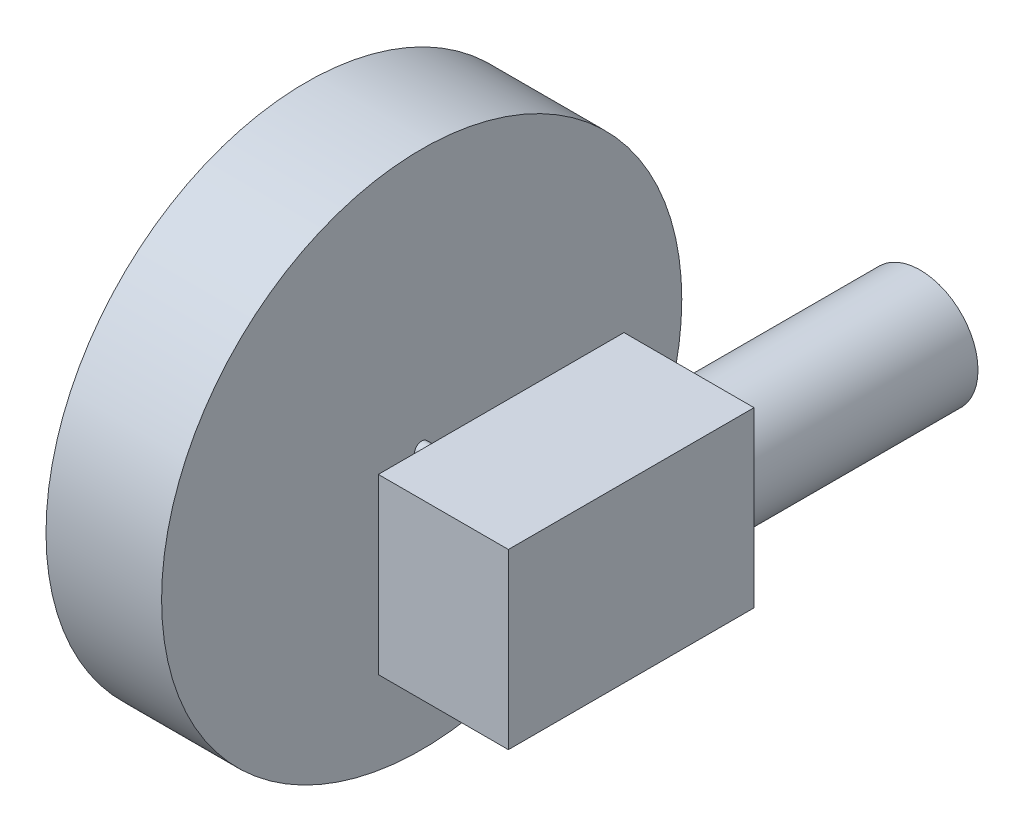
ISO-10303-21;
HEADER;
FILE_DESCRIPTION(('STEP AP214'),'2;1');
FILE_NAME('part.step','',(''),(''),'','','');
FILE_SCHEMA(('AUTOMOTIVE_DESIGN { 1 0 10303 214 1 1 1 1 }'));
ENDSEC;
DATA;
#1=APPLICATION_CONTEXT('core data for automotive mechanical design processes');
#2=APPLICATION_PROTOCOL_DEFINITION('international standard','automotive_design',2000,#1);
#3=PRODUCT_CONTEXT('',#1,'mechanical');
#4=PRODUCT('Part','Part','',(#3));
#5=PRODUCT_RELATED_PRODUCT_CATEGORY('part','',(#4));
#6=PRODUCT_DEFINITION_FORMATION('','',#4);
#7=PRODUCT_DEFINITION_CONTEXT('part definition',#1,'design');
#8=PRODUCT_DEFINITION('design','',#6,#7);
#9=PRODUCT_DEFINITION_SHAPE('','',#8);
#10=(LENGTH_UNIT() NAMED_UNIT(*) SI_UNIT(.MILLI.,.METRE.));
#11=(NAMED_UNIT(*) PLANE_ANGLE_UNIT() SI_UNIT($,.RADIAN.));
#12=(NAMED_UNIT(*) SI_UNIT($,.STERADIAN.) SOLID_ANGLE_UNIT());
#13=UNCERTAINTY_MEASURE_WITH_UNIT(LENGTH_MEASURE(1.E-05),#10,'distance_accuracy_value','');
#14=(GEOMETRIC_REPRESENTATION_CONTEXT(3) GLOBAL_UNCERTAINTY_ASSIGNED_CONTEXT((#13)) GLOBAL_UNIT_ASSIGNED_CONTEXT((#10,
#11,#12)) REPRESENTATION_CONTEXT('',''));
#15=CARTESIAN_POINT('',(0.,0.,0.));
#16=DIRECTION('',(0.,0.,1.));
#17=DIRECTION('',(1.,0.,0.));
#18=AXIS2_PLACEMENT_3D('',#15,#16,#17);
#19=CARTESIAN_POINT('',(-90.,0.,0.));
#20=DIRECTION('',(0.,0.,-1.));
#21=DIRECTION('',(1.,0.,0.));
#22=AXIS2_PLACEMENT_3D('',#19,#20,#21);
#23=PLANE('',#22);
#24=DIRECTION('',(0.,-1.,0.));
#25=VECTOR('',#24,1.);
#26=CARTESIAN_POINT('',(0.,0.,0.));
#27=LINE('',#26,#25);
#28=CARTESIAN_POINT('',(0.,120.,0.));
#29=VERTEX_POINT('',#28);
#30=CARTESIAN_POINT('',(0.,0.,0.));
#31=VERTEX_POINT('',#30);
#32=EDGE_CURVE('E103',#29,#31,#27,.T.);
#33=ORIENTED_EDGE('',*,*,#32,.F.);
#34=DIRECTION('',(1.,0.,0.));
#35=VECTOR('',#34,1.);
#36=CARTESIAN_POINT('',(-90.,120.,0.));
#37=LINE('',#36,#35);
#38=CARTESIAN_POINT('',(-90.,120.,0.));
#39=VERTEX_POINT('',#38);
#40=EDGE_CURVE('E102',#39,#29,#37,.T.);
#41=ORIENTED_EDGE('',*,*,#40,.F.);
#42=DIRECTION('',(0.,-1.,0.));
#43=VECTOR('',#42,1.);
#44=CARTESIAN_POINT('',(-90.,0.,0.));
#45=LINE('',#44,#43);
#46=CARTESIAN_POINT('',(-90.,0.,0.));
#47=VERTEX_POINT('',#46);
#48=EDGE_CURVE('E96',#39,#47,#45,.T.);
#49=ORIENTED_EDGE('',*,*,#48,.T.);
#50=DIRECTION('',(1.,0.,0.));
#51=VECTOR('',#50,1.);
#52=CARTESIAN_POINT('',(-90.,0.,0.));
#53=LINE('',#52,#51);
#54=EDGE_CURVE('E90',#47,#31,#53,.T.);
#55=ORIENTED_EDGE('',*,*,#54,.T.);
#56=EDGE_LOOP('',(#33,#41,#49,#55));
#57=FACE_BOUND('',#56,.T.);
#58=ADVANCED_FACE('F35',(#57),#23,.F.);
#59=CARTESIAN_POINT('',(-90.,0.,0.));
#60=DIRECTION('',(0.,1.,0.));
#61=DIRECTION('',(0.,0.,1.));
#62=AXIS2_PLACEMENT_3D('',#59,#60,#61);
#63=PLANE('',#62);
#64=DIRECTION('',(0.,0.,-1.));
#65=VECTOR('',#64,1.);
#66=CARTESIAN_POINT('',(0.,0.,0.));
#67=LINE('',#66,#65);
#68=CARTESIAN_POINT('',(0.,0.,-170.));
#69=VERTEX_POINT('',#68);
#70=EDGE_CURVE('E105',#31,#69,#67,.T.);
#71=ORIENTED_EDGE('',*,*,#70,.F.);
#72=ORIENTED_EDGE('',*,*,#54,.F.);
#73=DIRECTION('',(0.,0.,-1.));
#74=VECTOR('',#73,1.);
#75=CARTESIAN_POINT('',(-90.,0.,0.));
#76=LINE('',#75,#74);
#77=CARTESIAN_POINT('',(-90.,0.,-170.));
#78=VERTEX_POINT('',#77);
#79=EDGE_CURVE('E76',#47,#78,#76,.T.);
#80=ORIENTED_EDGE('',*,*,#79,.T.);
#81=DIRECTION('',(1.,0.,0.));
#82=VECTOR('',#81,1.);
#83=CARTESIAN_POINT('',(-90.,0.,-170.));
#84=LINE('',#83,#82);
#85=EDGE_CURVE('E85',#78,#69,#84,.T.);
#86=ORIENTED_EDGE('',*,*,#85,.T.);
#87=EDGE_LOOP('',(#71,#72,#80,#86));
#88=FACE_BOUND('',#87,.T.);
#89=ADVANCED_FACE('F93',(#88),#63,.F.);
#90=CARTESIAN_POINT('',(-90.,0.,-170.));
#91=DIRECTION('',(0.,0.,1.));
#92=DIRECTION('',(-1.,0.,0.));
#93=AXIS2_PLACEMENT_3D('',#90,#91,#92);
#94=PLANE('',#93);
#95=CARTESIAN_POINT('',(-45.,60.,-170.));
#96=DIRECTION('',(0.,0.,1.));
#97=DIRECTION('',(1.,0.,0.));
#98=AXIS2_PLACEMENT_3D('',#95,#96,#97);
#99=CIRCLE('',#98,40.);
#100=CARTESIAN_POINT('',(-4.99999999999999,60.,-170.));
#101=VERTEX_POINT('',#100);
#102=EDGE_CURVE('E43',#101,#101,#99,.T.);
#103=ORIENTED_EDGE('',*,*,#102,.T.);
#104=EDGE_LOOP('',(#103));
#105=FACE_BOUND('',#104,.T.);
#106=DIRECTION('',(0.,1.,0.));
#107=VECTOR('',#106,1.);
#108=CARTESIAN_POINT('',(0.,0.,-170.));
#109=LINE('',#108,#107);
#110=CARTESIAN_POINT('',(0.,120.,-170.));
#111=VERTEX_POINT('',#110);
#112=EDGE_CURVE('E87',#69,#111,#109,.T.);
#113=ORIENTED_EDGE('',*,*,#112,.F.);
#114=ORIENTED_EDGE('',*,*,#85,.F.);
#115=DIRECTION('',(0.,1.,0.));
#116=VECTOR('',#115,1.);
#117=CARTESIAN_POINT('',(-90.,0.,-170.));
#118=LINE('',#117,#116);
#119=CARTESIAN_POINT('',(-90.,120.,-170.));
#120=VERTEX_POINT('',#119);
#121=EDGE_CURVE('E79',#78,#120,#118,.T.);
#122=ORIENTED_EDGE('',*,*,#121,.T.);
#123=DIRECTION('',(1.,0.,0.));
#124=VECTOR('',#123,1.);
#125=CARTESIAN_POINT('',(-90.,120.,-170.));
#126=LINE('',#125,#124);
#127=EDGE_CURVE('E91',#120,#111,#126,.T.);
#128=ORIENTED_EDGE('',*,*,#127,.T.);
#129=EDGE_LOOP('',(#113,#114,#122,#128));
#130=FACE_BOUND('',#129,.T.);
#131=ADVANCED_FACE('F86',(#105,#130),#94,.F.);
#132=CARTESIAN_POINT('',(-90.,120.,0.));
#133=DIRECTION('',(0.,-1.,0.));
#134=DIRECTION('',(0.,0.,-1.));
#135=AXIS2_PLACEMENT_3D('',#132,#133,#134);
#136=PLANE('',#135);
#137=DIRECTION('',(0.,0.,1.));
#138=VECTOR('',#137,1.);
#139=CARTESIAN_POINT('',(0.,120.,0.));
#140=LINE('',#139,#138);
#141=EDGE_CURVE('E65',#111,#29,#140,.T.);
#142=ORIENTED_EDGE('',*,*,#141,.F.);
#143=ORIENTED_EDGE('',*,*,#127,.F.);
#144=DIRECTION('',(0.,0.,1.));
#145=VECTOR('',#144,1.);
#146=CARTESIAN_POINT('',(-90.,120.,0.));
#147=LINE('',#146,#145);
#148=EDGE_CURVE('E51',#120,#39,#147,.T.);
#149=ORIENTED_EDGE('',*,*,#148,.T.);
#150=ORIENTED_EDGE('',*,*,#40,.T.);
#151=EDGE_LOOP('',(#142,#143,#149,#150));
#152=FACE_BOUND('',#151,.T.);
#153=ADVANCED_FACE('F160',(#152),#136,.F.);
#154=CARTESIAN_POINT('',(-90.,0.,0.));
#155=DIRECTION('',(1.,0.,0.));
#156=DIRECTION('',(0.,0.,1.));
#157=AXIS2_PLACEMENT_3D('',#154,#155,#156);
#158=PLANE('',#157);
#159=CARTESIAN_POINT('',(-90.,70.,-80.));
#160=DIRECTION('',(-1.,0.,0.));
#161=DIRECTION('',(0.,0.,1.));
#162=AXIS2_PLACEMENT_3D('',#159,#160,#161);
#163=CIRCLE('',#162,5.00000000000001);
#164=CARTESIAN_POINT('',(-90.,70.,-75.));
#165=VERTEX_POINT('',#164);
#166=EDGE_CURVE('E11',#165,#165,#163,.F.);
#167=ORIENTED_EDGE('',*,*,#166,.T.);
#168=EDGE_LOOP('',(#167));
#169=FACE_BOUND('',#168,.T.);
#170=ORIENTED_EDGE('',*,*,#48,.F.);
#171=ORIENTED_EDGE('',*,*,#148,.F.);
#172=ORIENTED_EDGE('',*,*,#121,.F.);
#173=ORIENTED_EDGE('',*,*,#79,.F.);
#174=EDGE_LOOP('',(#170,#171,#172,#173));
#175=FACE_BOUND('',#174,.T.);
#176=ADVANCED_FACE('F81',(#169,#175),#158,.F.);
#177=CARTESIAN_POINT('',(0.,0.,0.));
#178=DIRECTION('',(1.,0.,0.));
#179=DIRECTION('',(0.,0.,1.));
#180=AXIS2_PLACEMENT_3D('',#177,#178,#179);
#181=PLANE('',#180);
#182=ORIENTED_EDGE('',*,*,#32,.T.);
#183=ORIENTED_EDGE('',*,*,#70,.T.);
#184=ORIENTED_EDGE('',*,*,#112,.T.);
#185=ORIENTED_EDGE('',*,*,#141,.T.);
#186=EDGE_LOOP('',(#182,#183,#184,#185));
#187=FACE_BOUND('',#186,.T.);
#188=ADVANCED_FACE('F149',(#187),#181,.T.);
#189=CARTESIAN_POINT('',(-45.,60.,-330.));
#190=DIRECTION('',(0.,0.,1.));
#191=DIRECTION('',(-1.,0.,0.));
#192=AXIS2_PLACEMENT_3D('',#189,#190,#191);
#193=CYLINDRICAL_SURFACE('',#192,40.);
#194=CARTESIAN_POINT('',(-45.,60.,-330.));
#195=DIRECTION('',(0.,0.,1.));
#196=DIRECTION('',(1.,0.,0.));
#197=AXIS2_PLACEMENT_3D('',#194,#195,#196);
#198=CIRCLE('',#197,40.);
#199=CARTESIAN_POINT('',(-4.99999999999999,60.,-330.));
#200=VERTEX_POINT('',#199);
#201=EDGE_CURVE('E106',#200,#200,#198,.T.);
#202=ORIENTED_EDGE('',*,*,#201,.T.);
#203=EDGE_LOOP('',(#202));
#204=FACE_BOUND('',#203,.T.);
#205=ORIENTED_EDGE('',*,*,#102,.F.);
#206=EDGE_LOOP('',(#205));
#207=FACE_BOUND('',#206,.T.);
#208=ADVANCED_FACE('F151',(#204,#207),#193,.T.);
#209=CARTESIAN_POINT('',(-45.,60.,-330.));
#210=DIRECTION('',(0.,0.,-1.));
#211=DIRECTION('',(1.,0.,0.));
#212=AXIS2_PLACEMENT_3D('',#209,#210,#211);
#213=PLANE('',#212);
#214=ORIENTED_EDGE('',*,*,#201,.F.);
#215=EDGE_LOOP('',(#214));
#216=FACE_BOUND('',#215,.T.);
#217=ADVANCED_FACE('F157',(#216),#213,.T.);
#218=CARTESIAN_POINT('',(-140.,70.,-80.));
#219=DIRECTION('',(1.,0.,0.));
#220=DIRECTION('',(0.,0.,1.));
#221=AXIS2_PLACEMENT_3D('',#218,#219,#220);
#222=CYLINDRICAL_SURFACE('',#221,5.00000000000001);
#223=CARTESIAN_POINT('',(-140.,70.,-80.));
#224=DIRECTION('',(1.,0.,0.));
#225=DIRECTION('',(0.,0.,-1.));
#226=AXIS2_PLACEMENT_3D('',#223,#224,#225);
#227=CIRCLE('',#226,5.00000000000001);
#228=CARTESIAN_POINT('',(-140.,70.,-85.));
#229=VERTEX_POINT('',#228);
#230=EDGE_CURVE('E119',#229,#229,#227,.T.);
#231=ORIENTED_EDGE('',*,*,#230,.T.);
#232=EDGE_LOOP('',(#231));
#233=FACE_BOUND('',#232,.T.);
#234=ORIENTED_EDGE('',*,*,#166,.F.);
#235=EDGE_LOOP('',(#234));
#236=FACE_BOUND('',#235,.T.);
#237=ADVANCED_FACE('F142',(#233,#236),#222,.T.);
#238=CARTESIAN_POINT('',(-220.,70.,-80.));
#239=DIRECTION('',(1.,0.,0.));
#240=DIRECTION('',(0.,0.,1.));
#241=AXIS2_PLACEMENT_3D('',#238,#239,#240);
#242=CYLINDRICAL_SURFACE('',#241,180.);
#243=CARTESIAN_POINT('',(-220.,70.,-80.));
#244=DIRECTION('',(1.,0.,0.));
#245=DIRECTION('',(0.,0.,-1.));
#246=AXIS2_PLACEMENT_3D('',#243,#244,#245);
#247=CIRCLE('',#246,180.);
#248=CARTESIAN_POINT('',(-220.,70.,-260.));
#249=VERTEX_POINT('',#248);
#250=EDGE_CURVE('E122',#249,#249,#247,.T.);
#251=ORIENTED_EDGE('',*,*,#250,.T.);
#252=EDGE_LOOP('',(#251));
#253=FACE_BOUND('',#252,.T.);
#254=CARTESIAN_POINT('',(-140.,70.,-80.));
#255=DIRECTION('',(1.,0.,0.));
#256=DIRECTION('',(0.,0.,-1.));
#257=AXIS2_PLACEMENT_3D('',#254,#255,#256);
#258=CIRCLE('',#257,180.);
#259=CARTESIAN_POINT('',(-140.,70.,-260.));
#260=VERTEX_POINT('',#259);
#261=EDGE_CURVE('E123',#260,#260,#258,.T.);
#262=ORIENTED_EDGE('',*,*,#261,.F.);
#263=EDGE_LOOP('',(#262));
#264=FACE_BOUND('',#263,.T.);
#265=ADVANCED_FACE('F129',(#253,#264),#242,.T.);
#266=CARTESIAN_POINT('',(-220.,70.,-80.));
#267=DIRECTION('',(-1.,0.,0.));
#268=DIRECTION('',(0.,0.,-1.));
#269=AXIS2_PLACEMENT_3D('',#266,#267,#268);
#270=PLANE('',#269);
#271=ORIENTED_EDGE('',*,*,#250,.F.);
#272=EDGE_LOOP('',(#271));
#273=FACE_BOUND('',#272,.T.);
#274=ADVANCED_FACE('F132',(#273),#270,.T.);
#275=CARTESIAN_POINT('',(-140.,70.,-80.));
#276=DIRECTION('',(-1.,0.,0.));
#277=DIRECTION('',(0.,0.,-1.));
#278=AXIS2_PLACEMENT_3D('',#275,#276,#277);
#279=PLANE('',#278);
#280=ORIENTED_EDGE('',*,*,#230,.F.);
#281=EDGE_LOOP('',(#280));
#282=FACE_BOUND('',#281,.T.);
#283=ORIENTED_EDGE('',*,*,#261,.T.);
#284=EDGE_LOOP('',(#283));
#285=FACE_BOUND('',#284,.T.);
#286=ADVANCED_FACE('F134',(#282,#285),#279,.F.);
#287=CLOSED_SHELL('',(#58,#89,#131,#153,#176,#188,#208,#217,#237,#265,#274,#286));
#288=MANIFOLD_SOLID_BREP('B2',#287);
#289=ADVANCED_BREP_SHAPE_REPRESENTATION('',(#18,#288),#14);
#290=SHAPE_DEFINITION_REPRESENTATION(#9,#289);
ENDSEC;
END-ISO-10303-21;
